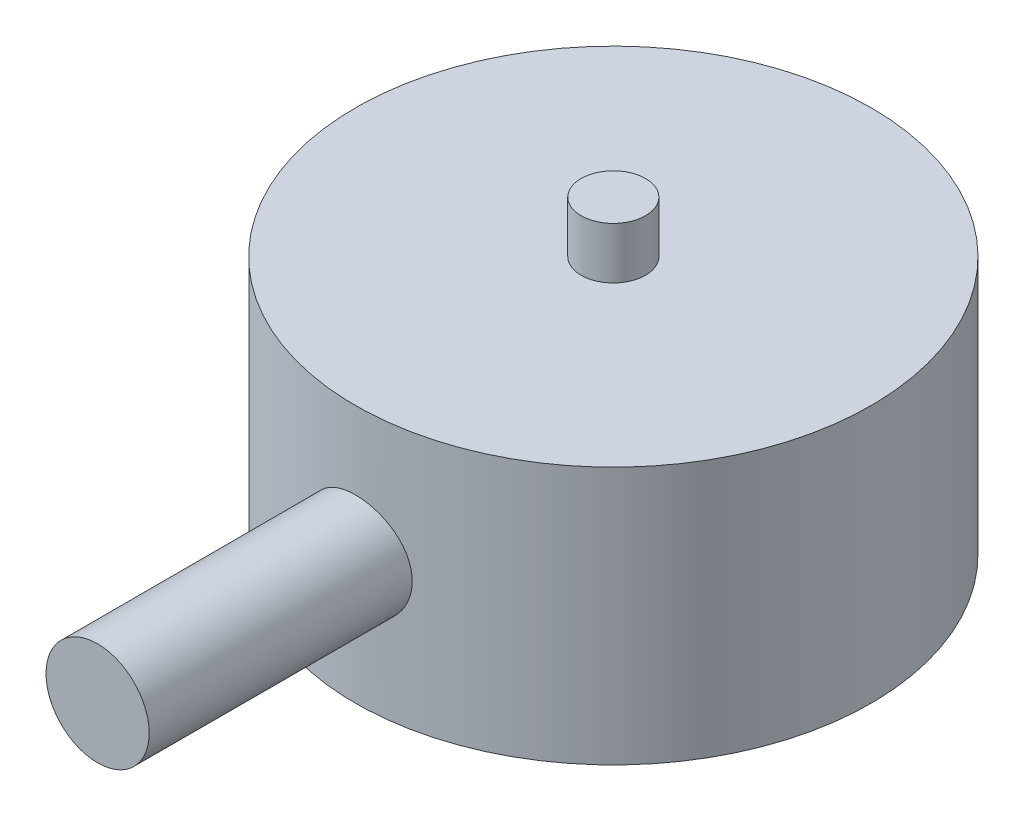
ISO-10303-21;
HEADER;
FILE_DESCRIPTION(('STEP AP214'),'2;1');
FILE_NAME('part.step','',(''),(''),'','','');
FILE_SCHEMA(('AUTOMOTIVE_DESIGN { 1 0 10303 214 1 1 1 1 }'));
ENDSEC;
DATA;
#1=APPLICATION_CONTEXT('core data for automotive mechanical design processes');
#2=APPLICATION_PROTOCOL_DEFINITION('international standard','automotive_design',2000,#1);
#3=PRODUCT_CONTEXT('',#1,'mechanical');
#4=PRODUCT('Part','Part','',(#3));
#5=PRODUCT_RELATED_PRODUCT_CATEGORY('part','',(#4));
#6=PRODUCT_DEFINITION_FORMATION('','',#4);
#7=PRODUCT_DEFINITION_CONTEXT('part definition',#1,'design');
#8=PRODUCT_DEFINITION('design','',#6,#7);
#9=PRODUCT_DEFINITION_SHAPE('','',#8);
#10=(LENGTH_UNIT() NAMED_UNIT(*) SI_UNIT(.MILLI.,.METRE.));
#11=(NAMED_UNIT(*) PLANE_ANGLE_UNIT() SI_UNIT($,.RADIAN.));
#12=(NAMED_UNIT(*) SI_UNIT($,.STERADIAN.) SOLID_ANGLE_UNIT());
#13=UNCERTAINTY_MEASURE_WITH_UNIT(LENGTH_MEASURE(1.E-05),#10,'distance_accuracy_value','');
#14=(GEOMETRIC_REPRESENTATION_CONTEXT(3) GLOBAL_UNCERTAINTY_ASSIGNED_CONTEXT((#13)) GLOBAL_UNIT_ASSIGNED_CONTEXT((#10,
#11,#12)) REPRESENTATION_CONTEXT('',''));
#15=CARTESIAN_POINT('',(0.,0.,0.));
#16=DIRECTION('',(0.,0.,1.));
#17=DIRECTION('',(1.,0.,0.));
#18=AXIS2_PLACEMENT_3D('',#15,#16,#17);
#19=CARTESIAN_POINT('',(0.,0.,0.));
#20=DIRECTION('',(0.,-1.,0.));
#21=DIRECTION('',(0.,0.,-1.));
#22=AXIS2_PLACEMENT_3D('',#19,#20,#21);
#23=CYLINDRICAL_SURFACE('',#22,10.);
#24=CARTESIAN_POINT('',(0.,-12.,0.));
#25=DIRECTION('',(0.,-1.,0.));
#26=DIRECTION('',(0.,0.,-1.));
#27=AXIS2_PLACEMENT_3D('',#24,#25,#26);
#28=CIRCLE('',#27,10.);
#29=CARTESIAN_POINT('',(0.,-12.,-10.));
#30=VERTEX_POINT('',#29);
#31=EDGE_CURVE('E59',#30,#30,#28,.T.);
#32=ORIENTED_EDGE('',*,*,#31,.F.);
#33=EDGE_LOOP('',(#32));
#34=FACE_BOUND('',#33,.T.);
#35=CARTESIAN_POINT('',(0.,-2.,0.));
#36=DIRECTION('',(0.,-1.,0.));
#37=DIRECTION('',(0.,0.,-1.));
#38=AXIS2_PLACEMENT_3D('',#35,#36,#37);
#39=CIRCLE('',#38,10.);
#40=CARTESIAN_POINT('',(0.,-2.,-10.));
#41=VERTEX_POINT('',#40);
#42=EDGE_CURVE('E54',#41,#41,#39,.T.);
#43=ORIENTED_EDGE('',*,*,#42,.T.);
#44=EDGE_LOOP('',(#43));
#45=FACE_BOUND('',#44,.T.);
#46=CARTESIAN_POINT('',(-2.,-7.,9.79795897113272));
#47=CARTESIAN_POINT('',(-1.99999589175054,-6.88887124901769,9.79796118053293));
#48=CARTESIAN_POINT('',(-1.99070634343629,-6.77769075333332,9.79987016537404));
#49=CARTESIAN_POINT('',(-1.95382456716568,-6.55847498971374,9.8072886260975));
#50=CARTESIAN_POINT('',(-1.92621769414099,-6.45044231072804,9.81280098289575));
#51=CARTESIAN_POINT('',(-1.85359156523949,-6.24072539329158,9.82677747443709));
#52=CARTESIAN_POINT('',(-1.80858962830524,-6.13903495693482,9.83523867242151));
#53=CARTESIAN_POINT('',(-1.70249821534101,-5.94465031060609,9.85415598961317));
#54=CARTESIAN_POINT('',(-1.6414096372023,-5.8519555989242,9.86461199746922));
#55=CARTESIAN_POINT('',(-1.50395815130687,-5.67687799229228,9.88650599388505));
#56=CARTESIAN_POINT('',(-1.42741131182664,-5.59464082423206,9.89795475674493));
#57=CARTESIAN_POINT('',(-1.26161357804262,-5.44408493284204,9.92044944605197));
#58=CARTESIAN_POINT('',(-1.17236179395597,-5.37576718516562,9.93149534421663));
#59=CARTESIAN_POINT('',(-0.982722711848511,-5.25442396474308,9.95205592835124));
#60=CARTESIAN_POINT('',(-0.882245135344421,-5.20153697236672,9.96155642883101));
#61=CARTESIAN_POINT('',(-0.673608300774543,-5.11345012590373,9.97783473767263));
#62=CARTESIAN_POINT('',(-0.565449762841106,-5.07824861619802,9.98461280088239));
#63=CARTESIAN_POINT('',(-0.346033546556989,-5.02698561276075,9.99460641376837));
#64=CARTESIAN_POINT('',(-0.234835478429628,-5.01067804485798,9.99786772576254));
#65=CARTESIAN_POINT('',(-0.011237136875073,-4.99689809632337,10.0006184236721));
#66=CARTESIAN_POINT('',(0.101163019663686,-4.99942390070836,10.0001081730552));
#67=CARTESIAN_POINT('',(0.322284001487177,-5.02305236043111,9.99540869737031));
#68=CARTESIAN_POINT('',(0.43103442859694,-5.0438899543357,9.99127196731677));
#69=CARTESIAN_POINT('',(0.643463253160602,-5.10313006491778,9.97984354318817));
#70=CARTESIAN_POINT('',(0.747141447494258,-5.14153328438374,9.97255172288078));
#71=CARTESIAN_POINT('',(0.947238926401774,-5.23506008029454,9.95554592039917));
#72=CARTESIAN_POINT('',(1.0436083482678,-5.29028750220977,9.94581696350447));
#73=CARTESIAN_POINT('',(1.22581009171951,-5.4158181544732,9.92500938947571));
#74=CARTESIAN_POINT('',(1.31164119905,-5.48612311954103,9.91393061710445));
#75=CARTESIAN_POINT('',(1.47190286210691,-5.64126724421694,9.89141928728919));
#76=CARTESIAN_POINT('',(1.54610863314726,-5.72633837345918,9.87998392915032));
#77=CARTESIAN_POINT('',(1.67923698635361,-5.9078328849015,9.85823143197521));
#78=CARTESIAN_POINT('',(1.7381592794555,-6.00425648176639,9.84791431409097));
#79=CARTESIAN_POINT('',(1.83912562960376,-6.20604166364361,9.82956094945848));
#80=CARTESIAN_POINT('',(1.88113329555542,-6.31142193527932,9.82152963127098));
#81=CARTESIAN_POINT('',(1.94678068325516,-6.52794264744798,9.80872952642546));
#82=CARTESIAN_POINT('',(1.97042279891328,-6.63908233523817,9.80396031456856));
#83=CARTESIAN_POINT('',(1.9983320120721,-6.86192971599809,9.79830958535655));
#84=CARTESIAN_POINT('',(2.00292371779582,-6.97359514862068,9.79736294114308));
#85=CARTESIAN_POINT('',(1.99347525662148,-7.19609644639937,9.79928971377708));
#86=CARTESIAN_POINT('',(1.97943614624488,-7.30693235823772,9.80216291400776));
#87=CARTESIAN_POINT('',(1.93340441614831,-7.52353728058447,9.8113446498983));
#88=CARTESIAN_POINT('',(1.9015852416786,-7.62934468607152,9.81761998028994));
#89=CARTESIAN_POINT('',(1.82108207061704,-7.83412655805748,9.8328697870333));
#90=CARTESIAN_POINT('',(1.77239668474635,-7.93310046087144,9.84184448572539));
#91=CARTESIAN_POINT('',(1.6588082844312,-8.12282621990032,9.86162811924079));
#92=CARTESIAN_POINT('',(1.59370215596551,-8.21345409260165,9.87245943729807));
#93=CARTESIAN_POINT('',(1.44939114442543,-8.38261662400183,9.89467447653273));
#94=CARTESIAN_POINT('',(1.37018481028908,-8.46115003649851,9.90605825447636));
#95=CARTESIAN_POINT('',(1.19846454699578,-8.60512511837115,9.92830691738431));
#96=CARTESIAN_POINT('',(1.10576499785926,-8.67034730929999,9.93916115417368));
#97=CARTESIAN_POINT('',(0.910535793269511,-8.78429176299917,9.9589425525724));
#98=CARTESIAN_POINT('',(0.808006550867014,-8.83301471868956,9.96786979510423));
#99=CARTESIAN_POINT('',(0.596605361648027,-8.91225774349327,9.98274588122133));
#100=CARTESIAN_POINT('',(0.487773346956158,-8.9428810364525,9.98871158285205));
#101=CARTESIAN_POINT('',(0.266378909359825,-8.98538249532769,9.99706471875323));
#102=CARTESIAN_POINT('',(0.153816937422425,-8.99726291895136,9.99945258399698));
#103=CARTESIAN_POINT('',(-0.0697457878072406,-9.00185396192578,10.0003708090823));
#104=CARTESIAN_POINT('',(-0.180739624282986,-8.99489456091245,9.99896757098659));
#105=CARTESIAN_POINT('',(-0.399942062631298,-8.96273209890435,9.99260087120678));
#106=CARTESIAN_POINT('',(-0.508150699507443,-8.93752926730374,9.98763745428863));
#107=CARTESIAN_POINT('',(-0.718505499490128,-8.86974201581682,9.97470996729842));
#108=CARTESIAN_POINT('',(-0.820664886480326,-8.82719724373805,9.9667527449523));
#109=CARTESIAN_POINT('',(-1.01644244037214,-8.72597551733778,9.9486944424736));
#110=CARTESIAN_POINT('',(-1.11005993153569,-8.667297288191,9.93859319293976));
#111=CARTESIAN_POINT('',(-1.28772778021183,-8.53436122587743,9.91715198313481));
#112=CARTESIAN_POINT('',(-1.37159943222969,-8.45986732723245,9.90579466835802));
#113=CARTESIAN_POINT('',(-1.52576523551701,-8.29789951980246,9.8832244581573));
#114=CARTESIAN_POINT('',(-1.59605616641783,-8.21042254104015,9.87201159757438));
#115=CARTESIAN_POINT('',(-1.72178443889996,-8.02384136661914,9.85086685467863));
#116=CARTESIAN_POINT('',(-1.77705362923618,-7.92462207775749,9.84095007142452));
#117=CARTESIAN_POINT('',(-1.87004809853245,-7.7181344534798,9.82370474252826));
#118=CARTESIAN_POINT('',(-1.90778929194832,-7.61087352262562,9.81637385049968));
#119=CARTESIAN_POINT('',(-1.95733827971531,-7.41947508911425,9.8065936227569));
#120=CARTESIAN_POINT('',(-1.97330779704737,-7.33642916097209,9.80337569829212));
#121=CARTESIAN_POINT('',(-1.99464003591942,-7.16893209089773,9.79905756918169));
#122=CARTESIAN_POINT('',(-2.00000312312529,-7.08448099751106,9.79795729152836));
#123=CARTESIAN_POINT('',(-2.,-7.,9.79795897113272));
#124=B_SPLINE_CURVE_WITH_KNOTS('',3,(#46,#47,#48,#49,#50,#51,#52,#53,#54,#55,#56,#57,#58,#59,
#60,#61,#62,#63,#64,#65,#66,#67,#68,#69,#70,#71,#72,#73,#74,#75,#76,#77,#78,#79,#80,#81,#82,#83,
#84,#85,#86,#87,#88,#89,#90,#91,#92,#93,#94,#95,#96,#97,#98,#99,#100,#101,#102,#103,#104,#105,
#106,#107,#108,#109,#110,#111,#112,#113,#114,#115,#116,#117,#118,#119,#120,#121,#122,#123),
.UNSPECIFIED.,.T.,.F.,(4,2,2,2,2,2,2,2,2,2,2,2,2,2,2,2,2,2,2,2,2,2,2,2,2,2,2,2,2,2,2,2,2,2,2,2,
2,2,4),(0.,0.333076927738856,0.666420478568593,0.999432995881172,1.33242692971973,
1.66964505096873,2.00688680070844,2.347068008749,2.68721736493119,3.02288497766161,
3.35852024232496,3.68937579267075,4.020244581475,4.35319848444606,4.68619071540132,
5.02498693524967,5.36378956245441,5.70331726345553,6.0428007003205,6.37647515609187,
6.71013069056843,7.04058683566638,7.37107020708797,7.70586119549042,8.04068665740418,
8.38065203466902,8.7206031326021,9.058596271573,9.39654869383256,9.72862034829372,
10.0606878273351,10.392000341509,10.7233390426937,11.0600230405119,11.3967867777956,
11.7371779715921,12.077259501804,12.3304760727632,12.5836839137096),.UNSPECIFIED.);
#125=CARTESIAN_POINT('',(-2.,-7.,9.79795897113272));
#126=VERTEX_POINT('',#125);
#127=EDGE_CURVE('E41',#126,#126,#124,.T.);
#128=ORIENTED_EDGE('',*,*,#127,.T.);
#129=EDGE_LOOP('',(#128));
#130=FACE_BOUND('',#129,.T.);
#131=ADVANCED_FACE('F37',(#34,#45,#130),#23,.T.);
#132=CARTESIAN_POINT('',(0.,0.,0.));
#133=DIRECTION('',(0.,1.,0.));
#134=DIRECTION('',(0.,0.,1.));
#135=AXIS2_PLACEMENT_3D('',#132,#133,#134);
#136=PLANE('',#135);
#137=CARTESIAN_POINT('',(0.,0.,0.));
#138=DIRECTION('',(0.,-1.,0.));
#139=DIRECTION('',(0.,0.,-1.));
#140=AXIS2_PLACEMENT_3D('',#137,#138,#139);
#141=CIRCLE('',#140,1.25);
#142=CARTESIAN_POINT('',(0.,0.,-1.25));
#143=VERTEX_POINT('',#142);
#144=EDGE_CURVE('E10',#143,#143,#141,.T.);
#145=ORIENTED_EDGE('',*,*,#144,.F.);
#146=EDGE_LOOP('',(#145));
#147=FACE_BOUND('',#146,.T.);
#148=ADVANCED_FACE('F39',(#147),#136,.T.);
#149=CARTESIAN_POINT('',(0.,0.,0.));
#150=DIRECTION('',(0.,-1.,0.));
#151=DIRECTION('',(0.,0.,-1.));
#152=AXIS2_PLACEMENT_3D('',#149,#150,#151);
#153=CYLINDRICAL_SURFACE('',#152,1.25);
#154=ORIENTED_EDGE('',*,*,#144,.T.);
#155=EDGE_LOOP('',(#154));
#156=FACE_BOUND('',#155,.T.);
#157=CARTESIAN_POINT('',(0.,-2.,0.));
#158=DIRECTION('',(0.,-1.,0.));
#159=DIRECTION('',(0.,0.,-1.));
#160=AXIS2_PLACEMENT_3D('',#157,#158,#159);
#161=CIRCLE('',#160,1.25);
#162=CARTESIAN_POINT('',(0.,-2.,-1.25));
#163=VERTEX_POINT('',#162);
#164=EDGE_CURVE('E50',#163,#163,#161,.T.);
#165=ORIENTED_EDGE('',*,*,#164,.F.);
#166=EDGE_LOOP('',(#165));
#167=FACE_BOUND('',#166,.T.);
#168=ADVANCED_FACE('F89',(#156,#167),#153,.T.);
#169=CARTESIAN_POINT('',(1.25,-2.,0.));
#170=DIRECTION('',(0.,1.,0.));
#171=DIRECTION('',(0.,0.,1.));
#172=AXIS2_PLACEMENT_3D('',#169,#170,#171);
#173=PLANE('',#172);
#174=ORIENTED_EDGE('',*,*,#164,.T.);
#175=EDGE_LOOP('',(#174));
#176=FACE_BOUND('',#175,.T.);
#177=ORIENTED_EDGE('',*,*,#42,.F.);
#178=EDGE_LOOP('',(#177));
#179=FACE_BOUND('',#178,.T.);
#180=ADVANCED_FACE('F81',(#176,#179),#173,.T.);
#181=CARTESIAN_POINT('',(10.,-12.,0.));
#182=DIRECTION('',(0.,-1.,0.));
#183=DIRECTION('',(0.,0.,-1.));
#184=AXIS2_PLACEMENT_3D('',#181,#182,#183);
#185=PLANE('',#184);
#186=ORIENTED_EDGE('',*,*,#31,.T.);
#187=EDGE_LOOP('',(#186));
#188=FACE_BOUND('',#187,.T.);
#189=ADVANCED_FACE('F74',(#188),#185,.T.);
#190=CARTESIAN_POINT('',(0.,-7.,20.));
#191=DIRECTION('',(0.,0.,-1.));
#192=DIRECTION('',(-1.,0.,0.));
#193=AXIS2_PLACEMENT_3D('',#190,#191,#192);
#194=CYLINDRICAL_SURFACE('',#193,2.);
#195=ORIENTED_EDGE('',*,*,#127,.F.);
#196=EDGE_LOOP('',(#195));
#197=FACE_BOUND('',#196,.T.);
#198=CARTESIAN_POINT('',(0.,-7.,20.));
#199=DIRECTION('',(0.,0.,1.));
#200=DIRECTION('',(1.,0.,0.));
#201=AXIS2_PLACEMENT_3D('',#198,#199,#200);
#202=CIRCLE('',#201,2.);
#203=CARTESIAN_POINT('',(2.,-7.,20.));
#204=VERTEX_POINT('',#203);
#205=EDGE_CURVE('E62',#204,#204,#202,.T.);
#206=ORIENTED_EDGE('',*,*,#205,.F.);
#207=EDGE_LOOP('',(#206));
#208=FACE_BOUND('',#207,.T.);
#209=ADVANCED_FACE('F70',(#197,#208),#194,.T.);
#210=CARTESIAN_POINT('',(0.,-7.,20.));
#211=DIRECTION('',(0.,0.,1.));
#212=DIRECTION('',(1.,0.,0.));
#213=AXIS2_PLACEMENT_3D('',#210,#211,#212);
#214=PLANE('',#213);
#215=ORIENTED_EDGE('',*,*,#205,.T.);
#216=EDGE_LOOP('',(#215));
#217=FACE_BOUND('',#216,.T.);
#218=ADVANCED_FACE('F73',(#217),#214,.T.);
#219=CLOSED_SHELL('',(#131,#148,#168,#180,#189,#209,#218));
#220=MANIFOLD_SOLID_BREP('B2',#219);
#221=ADVANCED_BREP_SHAPE_REPRESENTATION('',(#18,#220),#14);
#222=SHAPE_DEFINITION_REPRESENTATION(#9,#221);
ENDSEC;
END-ISO-10303-21;
